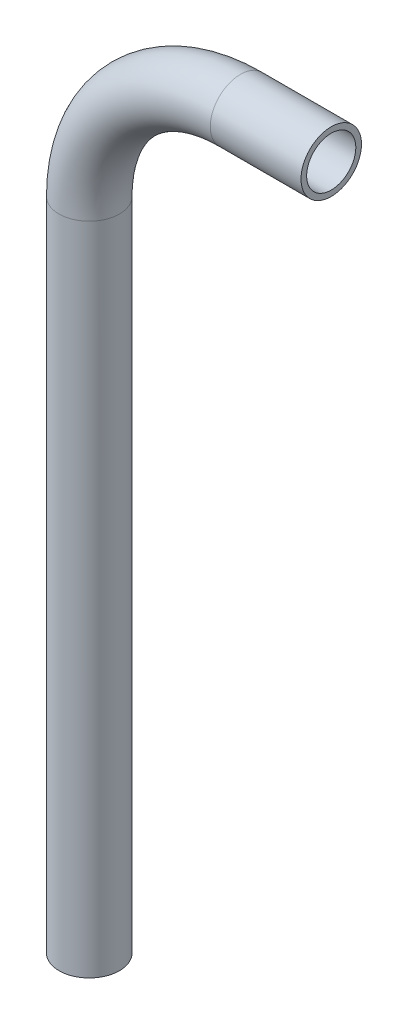
ISO-10303-21;
HEADER;
FILE_DESCRIPTION(('STEP AP214'),'2;1');
FILE_NAME('part.step','',(''),(''),'','','');
FILE_SCHEMA(('AUTOMOTIVE_DESIGN { 1 0 10303 214 1 1 1 1 }'));
ENDSEC;
DATA;
#1=APPLICATION_CONTEXT('core data for automotive mechanical design processes');
#2=APPLICATION_PROTOCOL_DEFINITION('international standard','automotive_design',2000,#1);
#3=PRODUCT_CONTEXT('',#1,'mechanical');
#4=PRODUCT('Part','Part','',(#3));
#5=PRODUCT_RELATED_PRODUCT_CATEGORY('part','',(#4));
#6=PRODUCT_DEFINITION_FORMATION('','',#4);
#7=PRODUCT_DEFINITION_CONTEXT('part definition',#1,'design');
#8=PRODUCT_DEFINITION('design','',#6,#7);
#9=PRODUCT_DEFINITION_SHAPE('','',#8);
#10=(LENGTH_UNIT() NAMED_UNIT(*) SI_UNIT(.MILLI.,.METRE.));
#11=(NAMED_UNIT(*) PLANE_ANGLE_UNIT() SI_UNIT($,.RADIAN.));
#12=(NAMED_UNIT(*) SI_UNIT($,.STERADIAN.) SOLID_ANGLE_UNIT());
#13=UNCERTAINTY_MEASURE_WITH_UNIT(LENGTH_MEASURE(1.E-05),#10,'distance_accuracy_value','');
#14=(GEOMETRIC_REPRESENTATION_CONTEXT(3) GLOBAL_UNCERTAINTY_ASSIGNED_CONTEXT((#13)) GLOBAL_UNIT_ASSIGNED_CONTEXT((#10,
#11,#12)) REPRESENTATION_CONTEXT('',''));
#15=CARTESIAN_POINT('',(0.,0.,0.));
#16=DIRECTION('',(0.,0.,1.));
#17=DIRECTION('',(1.,0.,0.));
#18=AXIS2_PLACEMENT_3D('',#15,#16,#17);
#19=CARTESIAN_POINT('',(0.,-127.,0.));
#20=DIRECTION('',(0.,1.,0.));
#21=DIRECTION('',(-1.,0.,0.));
#22=AXIS2_PLACEMENT_3D('',#19,#20,#21);
#23=CYLINDRICAL_SURFACE('',#22,4.7625);
#24=CARTESIAN_POINT('',(0.,-23.8125000000002,0.));
#25=DIRECTION('',(0.,1.,0.));
#26=DIRECTION('',(0.,0.,-1.));
#27=AXIS2_PLACEMENT_3D('',#24,#25,#26);
#28=CIRCLE('',#27,4.7625);
#29=CARTESIAN_POINT('',(-4.7625,-23.8125000000002,0.));
#30=VERTEX_POINT('',#29);
#31=EDGE_CURVE('E80',#30,#30,#28,.T.);
#32=ORIENTED_EDGE('',*,*,#31,.F.);
#33=EDGE_LOOP('',(#32));
#34=FACE_BOUND('',#33,.T.);
#35=CARTESIAN_POINT('',(0.,-127.,0.));
#36=DIRECTION('',(0.,1.,0.));
#37=DIRECTION('',(0.,0.,-1.));
#38=AXIS2_PLACEMENT_3D('',#35,#36,#37);
#39=CIRCLE('',#38,4.7625);
#40=CARTESIAN_POINT('',(0.,-127.,-4.7625));
#41=VERTEX_POINT('',#40);
#42=EDGE_CURVE('E49',#41,#41,#39,.T.);
#43=ORIENTED_EDGE('',*,*,#42,.T.);
#44=EDGE_LOOP('',(#43));
#45=FACE_BOUND('',#44,.T.);
#46=ADVANCED_FACE('F34',(#34,#45),#23,.T.);
#47=CARTESIAN_POINT('',(23.8125,-23.8125,0.));
#48=DIRECTION('',(0.,0.,-1.));
#49=DIRECTION('',(-1.,0.,0.));
#50=AXIS2_PLACEMENT_3D('',#47,#48,#49);
#51=TOROIDAL_SURFACE('',#50,23.8125,4.7625);
#52=CARTESIAN_POINT('',(23.8125000000002,2.66453525910038E-13,0.));
#53=DIRECTION('',(1.,0.,0.));
#54=DIRECTION('',(0.,0.,-1.));
#55=AXIS2_PLACEMENT_3D('',#52,#53,#54);
#56=CIRCLE('',#55,4.7625);
#57=CARTESIAN_POINT('',(23.8125000000002,4.7625,0.));
#58=VERTEX_POINT('',#57);
#59=EDGE_CURVE('E38',#58,#58,#56,.T.);
#60=CARTESIAN_POINT('',(23.8125,-23.8125,0.));
#61=DIRECTION('',(0.,0.,-1.));
#62=DIRECTION('',(-1.,0.,0.));
#63=AXIS2_PLACEMENT_3D('',#60,#61,#62);
#64=CIRCLE('',#63,28.575);
#65=EDGE_CURVE('',#30,#58,#64,.T.);
#66=ORIENTED_EDGE('',*,*,#31,.T.);
#67=ORIENTED_EDGE('',*,*,#59,.F.);
#68=ORIENTED_EDGE('',*,*,#65,.T.);
#69=ORIENTED_EDGE('',*,*,#65,.F.);
#70=EDGE_LOOP('',(#66,#68,#67,#69));
#71=FACE_BOUND('',#70,.T.);
#72=ADVANCED_FACE('F88',(#71),#51,.T.);
#73=CARTESIAN_POINT('',(23.8125000000002,0.,0.));
#74=DIRECTION('',(1.,0.,0.));
#75=DIRECTION('',(0.,0.,-1.));
#76=AXIS2_PLACEMENT_3D('',#73,#74,#75);
#77=CYLINDRICAL_SURFACE('',#76,4.7625);
#78=CARTESIAN_POINT('',(38.1,0.,0.));
#79=DIRECTION('',(1.,0.,0.));
#80=DIRECTION('',(0.,0.,-1.));
#81=AXIS2_PLACEMENT_3D('',#78,#79,#80);
#82=CIRCLE('',#81,4.7625);
#83=CARTESIAN_POINT('',(38.1,0.,-4.7625));
#84=VERTEX_POINT('',#83);
#85=EDGE_CURVE('E54',#84,#84,#82,.T.);
#86=ORIENTED_EDGE('',*,*,#85,.F.);
#87=EDGE_LOOP('',(#86));
#88=FACE_BOUND('',#87,.T.);
#89=ORIENTED_EDGE('',*,*,#59,.T.);
#90=EDGE_LOOP('',(#89));
#91=FACE_BOUND('',#90,.T.);
#92=ADVANCED_FACE('F36',(#88,#91),#77,.T.);
#93=CARTESIAN_POINT('',(0.,-127.,0.));
#94=DIRECTION('',(0.,1.,0.));
#95=DIRECTION('',(0.,0.,-1.));
#96=AXIS2_PLACEMENT_3D('',#93,#94,#95);
#97=PLANE('',#96);
#98=CARTESIAN_POINT('',(0.,-127.,0.));
#99=DIRECTION('',(0.,1.,0.));
#100=DIRECTION('',(0.,0.,-1.));
#101=AXIS2_PLACEMENT_3D('',#98,#99,#100);
#102=CIRCLE('',#101,3.8735);
#103=CARTESIAN_POINT('',(0.,-127.,-3.8735));
#104=VERTEX_POINT('',#103);
#105=EDGE_CURVE('E75',#104,#104,#102,.F.);
#106=ORIENTED_EDGE('',*,*,#105,.F.);
#107=EDGE_LOOP('',(#106));
#108=FACE_BOUND('',#107,.T.);
#109=ORIENTED_EDGE('',*,*,#42,.F.);
#110=EDGE_LOOP('',(#109));
#111=FACE_BOUND('',#110,.T.);
#112=ADVANCED_FACE('F94',(#108,#111),#97,.F.);
#113=CARTESIAN_POINT('',(38.1,0.,0.));
#114=DIRECTION('',(1.,0.,0.));
#115=DIRECTION('',(0.,0.,-1.));
#116=AXIS2_PLACEMENT_3D('',#113,#114,#115);
#117=PLANE('',#116);
#118=CARTESIAN_POINT('',(38.1,0.,0.));
#119=DIRECTION('',(1.,0.,0.));
#120=DIRECTION('',(0.,0.,-1.));
#121=AXIS2_PLACEMENT_3D('',#118,#119,#120);
#122=CIRCLE('',#121,3.8735);
#123=CARTESIAN_POINT('',(38.1,0.,-3.8735));
#124=VERTEX_POINT('',#123);
#125=EDGE_CURVE('E11',#124,#124,#122,.F.);
#126=ORIENTED_EDGE('',*,*,#125,.T.);
#127=EDGE_LOOP('',(#126));
#128=FACE_BOUND('',#127,.T.);
#129=ORIENTED_EDGE('',*,*,#85,.T.);
#130=EDGE_LOOP('',(#129));
#131=FACE_BOUND('',#130,.T.);
#132=ADVANCED_FACE('F61',(#128,#131),#117,.T.);
#133=CARTESIAN_POINT('',(0.,-127.,0.));
#134=DIRECTION('',(0.,1.,0.));
#135=DIRECTION('',(-1.,0.,0.));
#136=AXIS2_PLACEMENT_3D('',#133,#134,#135);
#137=CYLINDRICAL_SURFACE('',#136,3.8735);
#138=CARTESIAN_POINT('',(0.,-23.8125000000002,0.));
#139=DIRECTION('',(0.,1.,0.));
#140=DIRECTION('',(0.,0.,-1.));
#141=AXIS2_PLACEMENT_3D('',#138,#139,#140);
#142=CIRCLE('',#141,3.8735);
#143=CARTESIAN_POINT('',(-3.8735,-23.8125000000002,0.));
#144=VERTEX_POINT('',#143);
#145=EDGE_CURVE('E72',#144,#144,#142,.F.);
#146=ORIENTED_EDGE('',*,*,#145,.F.);
#147=EDGE_LOOP('',(#146));
#148=FACE_BOUND('',#147,.T.);
#149=ORIENTED_EDGE('',*,*,#105,.T.);
#150=EDGE_LOOP('',(#149));
#151=FACE_BOUND('',#150,.T.);
#152=ADVANCED_FACE('F102',(#148,#151),#137,.F.);
#153=CARTESIAN_POINT('',(23.8125,-23.8125,0.));
#154=DIRECTION('',(0.,0.,-1.));
#155=DIRECTION('',(-1.,0.,0.));
#156=AXIS2_PLACEMENT_3D('',#153,#154,#155);
#157=TOROIDAL_SURFACE('',#156,23.8125,3.8735);
#158=CARTESIAN_POINT('',(23.8125000000002,2.66453525910038E-13,0.));
#159=DIRECTION('',(1.,0.,0.));
#160=DIRECTION('',(0.,0.,-1.));
#161=AXIS2_PLACEMENT_3D('',#158,#159,#160);
#162=CIRCLE('',#161,3.8735);
#163=CARTESIAN_POINT('',(23.8125000000002,3.8735,0.));
#164=VERTEX_POINT('',#163);
#165=EDGE_CURVE('E43',#164,#164,#162,.F.);
#166=CARTESIAN_POINT('',(23.8125,-23.8125,0.));
#167=DIRECTION('',(0.,0.,-1.));
#168=DIRECTION('',(-1.,0.,0.));
#169=AXIS2_PLACEMENT_3D('',#166,#167,#168);
#170=CIRCLE('',#169,27.686);
#171=EDGE_CURVE('',#144,#164,#170,.T.);
#172=ORIENTED_EDGE('',*,*,#145,.T.);
#173=ORIENTED_EDGE('',*,*,#165,.F.);
#174=ORIENTED_EDGE('',*,*,#171,.T.);
#175=ORIENTED_EDGE('',*,*,#171,.F.);
#176=EDGE_LOOP('',(#172,#174,#173,#175));
#177=FACE_BOUND('',#176,.T.);
#178=ADVANCED_FACE('F67',(#177),#157,.F.);
#179=CARTESIAN_POINT('',(23.8125000000002,0.,0.));
#180=DIRECTION('',(1.,0.,0.));
#181=DIRECTION('',(0.,0.,-1.));
#182=AXIS2_PLACEMENT_3D('',#179,#180,#181);
#183=CYLINDRICAL_SURFACE('',#182,3.8735);
#184=ORIENTED_EDGE('',*,*,#125,.F.);
#185=EDGE_LOOP('',(#184));
#186=FACE_BOUND('',#185,.T.);
#187=ORIENTED_EDGE('',*,*,#165,.T.);
#188=EDGE_LOOP('',(#187));
#189=FACE_BOUND('',#188,.T.);
#190=ADVANCED_FACE('F64',(#186,#189),#183,.F.);
#191=CLOSED_SHELL('',(#46,#72,#92,#112,#132,#152,#178,#190));
#192=MANIFOLD_SOLID_BREP('B2',#191);
#193=ADVANCED_BREP_SHAPE_REPRESENTATION('',(#18,#192),#14);
#194=SHAPE_DEFINITION_REPRESENTATION(#9,#193);
ENDSEC;
END-ISO-10303-21;
